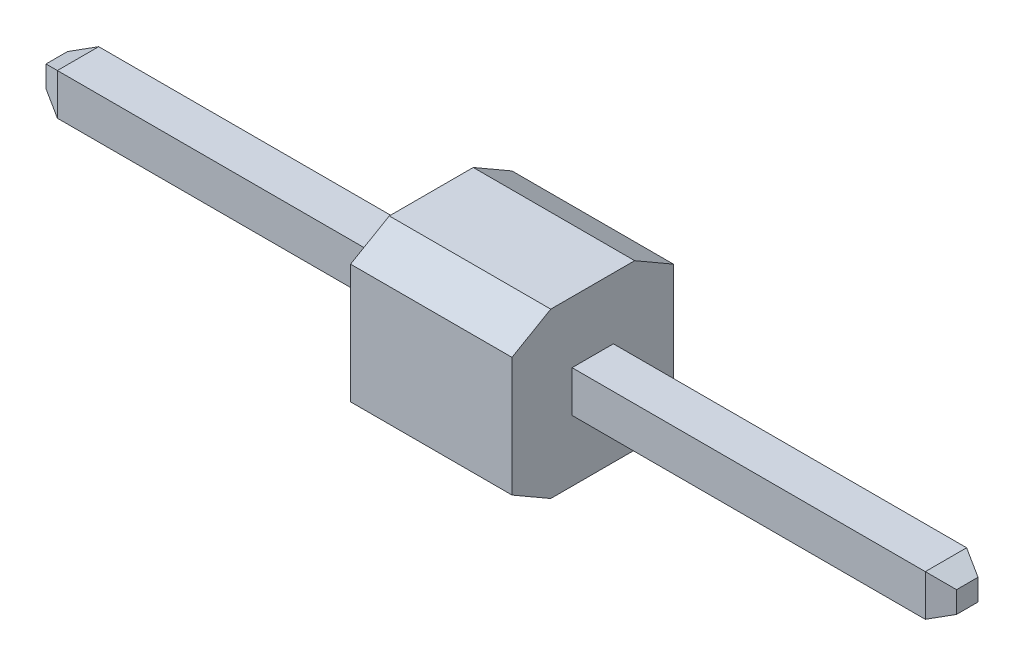
ISO-10303-21;
HEADER;
FILE_DESCRIPTION(('STEP AP214'),'2;1');
FILE_NAME('part.step','',(''),(''),'','','');
FILE_SCHEMA(('AUTOMOTIVE_DESIGN { 1 0 10303 214 1 1 1 1 }'));
ENDSEC;
DATA;
#1=APPLICATION_CONTEXT('core data for automotive mechanical design processes');
#2=APPLICATION_PROTOCOL_DEFINITION('international standard','automotive_design',2000,#1);
#3=PRODUCT_CONTEXT('',#1,'mechanical');
#4=PRODUCT('Part','Part','',(#3));
#5=PRODUCT_RELATED_PRODUCT_CATEGORY('part','',(#4));
#6=PRODUCT_DEFINITION_FORMATION('','',#4);
#7=PRODUCT_DEFINITION_CONTEXT('part definition',#1,'design');
#8=PRODUCT_DEFINITION('design','',#6,#7);
#9=PRODUCT_DEFINITION_SHAPE('','',#8);
#10=(LENGTH_UNIT() NAMED_UNIT(*) SI_UNIT(.MILLI.,.METRE.));
#11=(NAMED_UNIT(*) PLANE_ANGLE_UNIT() SI_UNIT($,.RADIAN.));
#12=(NAMED_UNIT(*) SI_UNIT($,.STERADIAN.) SOLID_ANGLE_UNIT());
#13=UNCERTAINTY_MEASURE_WITH_UNIT(LENGTH_MEASURE(1.E-05),#10,'distance_accuracy_value','');
#14=(GEOMETRIC_REPRESENTATION_CONTEXT(3) GLOBAL_UNCERTAINTY_ASSIGNED_CONTEXT((#13)) GLOBAL_UNIT_ASSIGNED_CONTEXT((#10,
#11,#12)) REPRESENTATION_CONTEXT('',''));
#15=CARTESIAN_POINT('',(0.,0.,0.));
#16=DIRECTION('',(0.,0.,1.));
#17=DIRECTION('',(1.,0.,0.));
#18=AXIS2_PLACEMENT_3D('',#15,#16,#17);
#19=CARTESIAN_POINT('',(5.42107483451908,2.2228784128063,0.629998634255617));
#20=DIRECTION('',(1.,4.37113882867379E-08,-4.37113882867379E-08));
#21=DIRECTION('',(-4.37113882867379E-08,1.,0.));
#22=AXIS2_PLACEMENT_3D('',#19,#20,#21);
#23=PLANE('',#22);
#24=DIRECTION('',(1.59994790123753E-08,0.500000000000193,0.866025403784327));
#25=VECTOR('',#24,1.);
#26=CARTESIAN_POINT('',(5.42107471153316,3.4664682512923,-0.940001365744382));
#27=LINE('',#26,#25);
#28=CARTESIAN_POINT('',(5.42107471153316,3.4664682512923,-0.940001365744382));
#29=VERTEX_POINT('',#28);
#30=CARTESIAN_POINT('',(5.42107472261793,3.8128784128063,-0.340001365744383));
#31=VERTEX_POINT('',#30);
#32=EDGE_CURVE('E11',#29,#31,#27,.T.);
#33=ORIENTED_EDGE('',*,*,#32,.T.);
#34=DIRECTION('',(4.37113880134522E-08,0.,0.999999999999999));
#35=VECTOR('',#34,1.);
#36=CARTESIAN_POINT('',(5.42107472261793,3.8128784128063,-0.340001365744383));
#37=LINE('',#36,#35);
#38=CARTESIAN_POINT('',(5.42107477944273,3.8128784128063,0.959998634255618));
#39=VERTEX_POINT('',#38);
#40=EDGE_CURVE('E304',#31,#39,#37,.T.);
#41=ORIENTED_EDGE('',*,*,#40,.T.);
#42=DIRECTION('',(5.97108668824037E-08,-0.500000000000186,0.866025403784329));
#43=VECTOR('',#42,1.);
#44=CARTESIAN_POINT('',(5.42107477944273,3.8128784128063,0.959998634255618));
#45=LINE('',#44,#43);
#46=CARTESIAN_POINT('',(5.42107482081163,3.46646825129231,1.55999863425562));
#47=VERTEX_POINT('',#46);
#48=EDGE_CURVE('E296',#39,#47,#45,.T.);
#49=ORIENTED_EDGE('',*,*,#48,.T.);
#50=DIRECTION('',(4.37113884816491E-08,-0.999999999999999,0.));
#51=VECTOR('',#50,1.);
#52=CARTESIAN_POINT('',(5.42107482081163,3.46646825129231,1.55999863425562));
#53=LINE('',#52,#51);
#54=CARTESIAN_POINT('',(5.42107490155442,1.6192885743263,1.55999863425562));
#55=VERTEX_POINT('',#54);
#56=EDGE_CURVE('E281',#47,#55,#53,.T.);
#57=ORIENTED_EDGE('',*,*,#56,.T.);
#58=DIRECTION('',(1.5999479012306E-08,0.500000000000192,0.866025403784328));
#59=VECTOR('',#58,1.);
#60=CARTESIAN_POINT('',(5.42107489046966,1.2728784128063,0.959998634255618));
#61=LINE('',#60,#59);
#62=CARTESIAN_POINT('',(5.42107489046966,1.2728784128063,0.959998634255618));
#63=VERTEX_POINT('',#62);
#64=EDGE_CURVE('E265',#63,#55,#61,.T.);
#65=ORIENTED_EDGE('',*,*,#64,.F.);
#66=DIRECTION('',(4.37113886966664E-08,0.,0.999999999999999));
#67=VECTOR('',#66,1.);
#68=CARTESIAN_POINT('',(5.42107483364485,1.2728784128063,-0.340001365744383));
#69=LINE('',#68,#67);
#70=CARTESIAN_POINT('',(5.42107483364485,1.2728784128063,-0.340001365744383));
#71=VERTEX_POINT('',#70);
#72=EDGE_CURVE('E248',#71,#63,#69,.T.);
#73=ORIENTED_EDGE('',*,*,#72,.F.);
#74=DIRECTION('',(5.971086560017E-08,-0.500000000000187,0.866025403784329));
#75=VECTOR('',#74,1.);
#76=CARTESIAN_POINT('',(5.42107479227595,1.6192885743263,-0.940001365744382));
#77=LINE('',#76,#75);
#78=CARTESIAN_POINT('',(5.42107479227595,1.6192885743263,-0.940001365744382));
#79=VERTEX_POINT('',#78);
#80=EDGE_CURVE('E242',#79,#71,#77,.T.);
#81=ORIENTED_EDGE('',*,*,#80,.F.);
#82=DIRECTION('',(4.37113884816491E-08,-0.999999999999999,0.));
#83=VECTOR('',#82,1.);
#84=CARTESIAN_POINT('',(5.42107471153316,3.4664682512923,-0.940001365744382));
#85=LINE('',#84,#83);
#86=EDGE_CURVE('E236',#29,#79,#85,.T.);
#87=ORIENTED_EDGE('',*,*,#86,.F.);
#88=EDGE_LOOP('',(#33,#41,#49,#57,#65,#73,#81,#87));
#89=FACE_BOUND('',#88,.T.);
#90=DIRECTION('',(-4.37113886753159E-08,0.,-0.999999999999999));
#91=VECTOR('',#90,1.);
#92=CARTESIAN_POINT('',(5.42107480654379,2.8628784128063,0.629998634255617));
#93=LINE('',#92,#91);
#94=CARTESIAN_POINT('',(5.42107480654379,2.8628784128063,0.629998634255617));
#95=VERTEX_POINT('',#94);
#96=CARTESIAN_POINT('',(5.4210747785685,2.8628784128063,-0.0100013657443826));
#97=VERTEX_POINT('',#96);
#98=EDGE_CURVE('E302',#95,#97,#93,.T.);
#99=ORIENTED_EDGE('',*,*,#98,.T.);
#100=DIRECTION('',(-4.37113886753159E-08,0.999999999999999,0.));
#101=VECTOR('',#100,1.);
#102=CARTESIAN_POINT('',(5.42107480654379,2.2228784128063,-0.0100013657443826));
#103=LINE('',#102,#101);
#104=CARTESIAN_POINT('',(5.42107480654379,2.2228784128063,-0.0100013657443826));
#105=VERTEX_POINT('',#104);
#106=EDGE_CURVE('E293',#105,#97,#103,.T.);
#107=ORIENTED_EDGE('',*,*,#106,.F.);
#108=DIRECTION('',(-4.37113886753159E-08,0.,-0.999999999999999));
#109=VECTOR('',#108,1.);
#110=CARTESIAN_POINT('',(5.42107483451908,2.2228784128063,0.629998634255617));
#111=LINE('',#110,#109);
#112=CARTESIAN_POINT('',(5.42107483451908,2.2228784128063,0.629998634255617));
#113=VERTEX_POINT('',#112);
#114=EDGE_CURVE('E278',#113,#105,#111,.T.);
#115=ORIENTED_EDGE('',*,*,#114,.F.);
#116=DIRECTION('',(-4.37113886753159E-08,0.999999999999999,0.));
#117=VECTOR('',#116,1.);
#118=CARTESIAN_POINT('',(5.42107483451908,2.2228784128063,0.629998634255617));
#119=LINE('',#118,#117);
#120=EDGE_CURVE('E263',#113,#95,#119,.T.);
#121=ORIENTED_EDGE('',*,*,#120,.T.);
#122=EDGE_LOOP('',(#99,#107,#115,#121));
#123=FACE_BOUND('',#122,.T.);
#124=ADVANCED_FACE('F17',(#89,#123),#23,.T.);
#125=CARTESIAN_POINT('',(2.92107483451908,2.22287830352783,0.629998743534088));
#126=DIRECTION('',(1.,4.37113882867379E-08,-4.37113882867379E-08));
#127=DIRECTION('',(-4.37113882867379E-08,1.,0.));
#128=AXIS2_PLACEMENT_3D('',#125,#126,#127);
#129=PLANE('',#128);
#130=DIRECTION('',(1.59994790123753E-08,0.500000000000193,0.866025403784327));
#131=VECTOR('',#130,1.);
#132=CARTESIAN_POINT('',(2.92107471153316,3.46646814201383,-0.940001256465912));
#133=LINE('',#132,#131);
#134=CARTESIAN_POINT('',(2.92107471153316,3.46646814201383,-0.940001256465912));
#135=VERTEX_POINT('',#134);
#136=CARTESIAN_POINT('',(2.92107472261793,3.81287830352783,-0.340001256465912));
#137=VERTEX_POINT('',#136);
#138=EDGE_CURVE('E24',#135,#137,#133,.T.);
#139=ORIENTED_EDGE('',*,*,#138,.F.);
#140=DIRECTION('',(4.37113884816491E-08,-0.999999999999999,0.));
#141=VECTOR('',#140,1.);
#142=CARTESIAN_POINT('',(2.92107471153316,3.46646814201383,-0.940001256465912));
#143=LINE('',#142,#141);
#144=CARTESIAN_POINT('',(2.92107479227595,1.61928846504783,-0.940001256465912));
#145=VERTEX_POINT('',#144);
#146=EDGE_CURVE('E300',#135,#145,#143,.T.);
#147=ORIENTED_EDGE('',*,*,#146,.T.);
#148=DIRECTION('',(5.97108662411576E-08,-0.500000000000187,0.866025403784329));
#149=VECTOR('',#148,1.);
#150=CARTESIAN_POINT('',(2.92107479227595,1.61928846504783,-0.940001256465912));
#151=LINE('',#150,#149);
#152=CARTESIAN_POINT('',(2.92107483364485,1.27287830352783,-0.340001256465912));
#153=VERTEX_POINT('',#152);
#154=EDGE_CURVE('E286',#145,#153,#151,.T.);
#155=ORIENTED_EDGE('',*,*,#154,.T.);
#156=DIRECTION('',(4.37113883550593E-08,0.,0.999999999999999));
#157=VECTOR('',#156,1.);
#158=CARTESIAN_POINT('',(2.92107483364485,1.27287830352783,-0.340001256465912));
#159=LINE('',#158,#157);
#160=CARTESIAN_POINT('',(2.92107489046966,1.27287830352783,0.959998743534088));
#161=VERTEX_POINT('',#160);
#162=EDGE_CURVE('E271',#153,#161,#159,.T.);
#163=ORIENTED_EDGE('',*,*,#162,.T.);
#164=DIRECTION('',(1.5999479012306E-08,0.500000000000192,0.866025403784328));
#165=VECTOR('',#164,1.);
#166=CARTESIAN_POINT('',(2.92107489046966,1.27287830352783,0.959998743534088));
#167=LINE('',#166,#165);
#168=CARTESIAN_POINT('',(2.92107490155442,1.61928846504783,1.55999874353409));
#169=VERTEX_POINT('',#168);
#170=EDGE_CURVE('E253',#161,#169,#167,.T.);
#171=ORIENTED_EDGE('',*,*,#170,.T.);
#172=DIRECTION('',(4.37113884816491E-08,-0.999999999999999,0.));
#173=VECTOR('',#172,1.);
#174=CARTESIAN_POINT('',(2.92107482081163,3.46646814201383,1.55999874353409));
#175=LINE('',#174,#173);
#176=CARTESIAN_POINT('',(2.92107482081163,3.46646814201383,1.55999874353409));
#177=VERTEX_POINT('',#176);
#178=EDGE_CURVE('E261',#177,#169,#175,.T.);
#179=ORIENTED_EDGE('',*,*,#178,.F.);
#180=DIRECTION('',(5.97108668824037E-08,-0.500000000000186,0.866025403784329));
#181=VECTOR('',#180,1.);
#182=CARTESIAN_POINT('',(2.92107477944273,3.81287830352783,0.959998743534088));
#183=LINE('',#182,#181);
#184=CARTESIAN_POINT('',(2.92107477944273,3.81287830352783,0.959998743534088));
#185=VERTEX_POINT('',#184);
#186=EDGE_CURVE('E276',#185,#177,#183,.T.);
#187=ORIENTED_EDGE('',*,*,#186,.F.);
#188=DIRECTION('',(4.37113880134522E-08,0.,0.999999999999999));
#189=VECTOR('',#188,1.);
#190=CARTESIAN_POINT('',(2.92107472261793,3.81287830352783,-0.340001256465912));
#191=LINE('',#190,#189);
#192=EDGE_CURVE('E291',#137,#185,#191,.T.);
#193=ORIENTED_EDGE('',*,*,#192,.F.);
#194=EDGE_LOOP('',(#139,#147,#155,#163,#171,#179,#187,#193));
#195=FACE_BOUND('',#194,.T.);
#196=DIRECTION('',(-4.37113886753159E-08,0.999999999999999,0.));
#197=VECTOR('',#196,1.);
#198=CARTESIAN_POINT('',(2.92107480654379,2.22287830352783,-0.0100012564659119));
#199=LINE('',#198,#197);
#200=CARTESIAN_POINT('',(2.92107480654379,2.22287830352783,-0.0100012564659119));
#201=VERTEX_POINT('',#200);
#202=CARTESIAN_POINT('',(2.9210747785685,2.86287830352783,-0.0100012564659119));
#203=VERTEX_POINT('',#202);
#204=EDGE_CURVE('E298',#201,#203,#199,.T.);
#205=ORIENTED_EDGE('',*,*,#204,.T.);
#206=DIRECTION('',(-4.37113886753159E-08,0.,-0.999999999999999));
#207=VECTOR('',#206,1.);
#208=CARTESIAN_POINT('',(2.92107480654379,2.86287830352783,0.629998743534088));
#209=LINE('',#208,#207);
#210=CARTESIAN_POINT('',(2.92107480654379,2.86287830352783,0.629998743534088));
#211=VERTEX_POINT('',#210);
#212=EDGE_CURVE('E283',#211,#203,#209,.T.);
#213=ORIENTED_EDGE('',*,*,#212,.F.);
#214=DIRECTION('',(-4.37113879814265E-08,0.999999999999999,0.));
#215=VECTOR('',#214,1.);
#216=CARTESIAN_POINT('',(2.92107483451908,2.22287830352783,0.629998743534088));
#217=LINE('',#216,#215);
#218=CARTESIAN_POINT('',(2.92107483451908,2.22287830352783,0.629998743534088));
#219=VERTEX_POINT('',#218);
#220=EDGE_CURVE('E268',#219,#211,#217,.T.);
#221=ORIENTED_EDGE('',*,*,#220,.F.);
#222=DIRECTION('',(-4.37113879814266E-08,0.,-0.999999999999999));
#223=VECTOR('',#222,1.);
#224=CARTESIAN_POINT('',(2.92107483451908,2.22287830352783,0.629998743534088));
#225=LINE('',#224,#223);
#226=EDGE_CURVE('E251',#219,#201,#225,.T.);
#227=ORIENTED_EDGE('',*,*,#226,.T.);
#228=EDGE_LOOP('',(#205,#213,#221,#227));
#229=FACE_BOUND('',#228,.T.);
#230=ADVANCED_FACE('F314',(#195,#229),#129,.F.);
#231=CARTESIAN_POINT('',(5.42107471153316,3.4664682512923,-0.940001365744382));
#232=DIRECTION('',(5.97108668343731E-08,-0.866025403784328,0.50000000000019));
#233=DIRECTION('',(-1.59994785476185E-08,-0.500000000000192,-0.866025403784329));
#234=AXIS2_PLACEMENT_3D('',#231,#232,#233);
#235=PLANE('',#234);
#236=ORIENTED_EDGE('',*,*,#138,.T.);
#237=DIRECTION('',(-0.999999999999998,-4.37113882867378E-08,4.37113883755557E-08));
#238=VECTOR('',#237,1.);
#239=CARTESIAN_POINT('',(5.42107472261793,3.8128784128063,-0.340001365744383));
#240=LINE('',#239,#238);
#241=EDGE_CURVE('E288',#31,#137,#240,.T.);
#242=ORIENTED_EDGE('',*,*,#241,.F.);
#243=ORIENTED_EDGE('',*,*,#32,.F.);
#244=DIRECTION('',(-0.999999999999998,-4.37113889972806E-08,4.37113881091022E-08));
#245=VECTOR('',#244,1.);
#246=CARTESIAN_POINT('',(5.42107471153316,3.4664682512923,-0.940001365744382));
#247=LINE('',#246,#245);
#248=EDGE_CURVE('E256',#29,#135,#247,.T.);
#249=ORIENTED_EDGE('',*,*,#248,.T.);
#250=EDGE_LOOP('',(#236,#242,#243,#249));
#251=FACE_BOUND('',#250,.T.);
#252=ADVANCED_FACE('F306',(#251),#235,.F.);
#253=CARTESIAN_POINT('',(5.42107472261793,3.8128784128063,-0.340001365744383));
#254=DIRECTION('',(4.37113882867379E-08,-1.,0.));
#255=DIRECTION('',(1.,4.37113882867379E-08,-4.37113882867379E-08));
#256=AXIS2_PLACEMENT_3D('',#253,#254,#255);
#257=PLANE('',#256);
#258=ORIENTED_EDGE('',*,*,#192,.T.);
#259=DIRECTION('',(-0.999999999999998,-4.37113882867378E-08,4.37113882867378E-08));
#260=VECTOR('',#259,1.);
#261=CARTESIAN_POINT('',(5.42107477944273,3.8128784128063,0.959998634255618));
#262=LINE('',#261,#260);
#263=EDGE_CURVE('E273',#39,#185,#262,.T.);
#264=ORIENTED_EDGE('',*,*,#263,.F.);
#265=ORIENTED_EDGE('',*,*,#40,.F.);
#266=ORIENTED_EDGE('',*,*,#241,.T.);
#267=EDGE_LOOP('',(#258,#264,#265,#266));
#268=FACE_BOUND('',#267,.T.);
#269=ADVANCED_FACE('F311',(#268),#257,.F.);
#270=CARTESIAN_POINT('',(5.42107477944273,3.8128784128063,0.959998634255618));
#271=DIRECTION('',(1.59994785476185E-08,-0.86602540378433,-0.50000000000019));
#272=DIRECTION('',(-5.97108668343731E-08,0.500000000000188,-0.866025403784329));
#273=AXIS2_PLACEMENT_3D('',#270,#271,#272);
#274=PLANE('',#273);
#275=ORIENTED_EDGE('',*,*,#186,.T.);
#276=DIRECTION('',(-0.999999999999998,-4.37113889972806E-08,4.37113882867378E-08));
#277=VECTOR('',#276,1.);
#278=CARTESIAN_POINT('',(5.42107482081163,3.46646825129231,1.55999863425562));
#279=LINE('',#278,#277);
#280=EDGE_CURVE('E258',#47,#177,#279,.T.);
#281=ORIENTED_EDGE('',*,*,#280,.F.);
#282=ORIENTED_EDGE('',*,*,#48,.F.);
#283=ORIENTED_EDGE('',*,*,#263,.T.);
#284=EDGE_LOOP('',(#275,#281,#282,#283));
#285=FACE_BOUND('',#284,.T.);
#286=ADVANCED_FACE('F319',(#285),#274,.F.);
#287=CARTESIAN_POINT('',(5.42107482081163,3.46646825129231,1.55999863425562));
#288=DIRECTION('',(-4.37113882867379E-08,0.,-1.));
#289=DIRECTION('',(-1.,-4.37113882867379E-08,4.37113882867379E-08));
#290=AXIS2_PLACEMENT_3D('',#287,#288,#289);
#291=PLANE('',#290);
#292=ORIENTED_EDGE('',*,*,#178,.T.);
#293=DIRECTION('',(-0.999999999999998,-4.37113889972806E-08,4.37113882867378E-08));
#294=VECTOR('',#293,1.);
#295=CARTESIAN_POINT('',(5.42107490155442,1.6192885743263,1.55999863425562));
#296=LINE('',#295,#294);
#297=EDGE_CURVE('E245',#55,#169,#296,.T.);
#298=ORIENTED_EDGE('',*,*,#297,.F.);
#299=ORIENTED_EDGE('',*,*,#56,.F.);
#300=ORIENTED_EDGE('',*,*,#280,.T.);
#301=EDGE_LOOP('',(#292,#298,#299,#300));
#302=FACE_BOUND('',#301,.T.);
#303=ADVANCED_FACE('F326',(#302),#291,.F.);
#304=CARTESIAN_POINT('',(5.42107489046966,1.2728784128063,0.959998634255618));
#305=DIRECTION('',(5.97108668343731E-08,-0.866025403784328,0.50000000000019));
#306=DIRECTION('',(-1.59994785476185E-08,-0.500000000000192,-0.866025403784329));
#307=AXIS2_PLACEMENT_3D('',#304,#305,#306);
#308=PLANE('',#307);
#309=ORIENTED_EDGE('',*,*,#170,.F.);
#310=DIRECTION('',(-0.999999999999998,-4.37113882867378E-08,4.37113882867378E-08));
#311=VECTOR('',#310,1.);
#312=CARTESIAN_POINT('',(5.42107489046966,1.2728784128063,0.959998634255618));
#313=LINE('',#312,#311);
#314=EDGE_CURVE('E239',#63,#161,#313,.T.);
#315=ORIENTED_EDGE('',*,*,#314,.F.);
#316=ORIENTED_EDGE('',*,*,#64,.T.);
#317=ORIENTED_EDGE('',*,*,#297,.T.);
#318=EDGE_LOOP('',(#309,#315,#316,#317));
#319=FACE_BOUND('',#318,.T.);
#320=ADVANCED_FACE('F329',(#319),#308,.T.);
#321=CARTESIAN_POINT('',(5.42107483364485,1.2728784128063,-0.340001365744383));
#322=DIRECTION('',(4.37113882867379E-08,-1.,0.));
#323=DIRECTION('',(1.,4.37113882867379E-08,-4.37113882867379E-08));
#324=AXIS2_PLACEMENT_3D('',#321,#322,#323);
#325=PLANE('',#324);
#326=ORIENTED_EDGE('',*,*,#162,.F.);
#327=DIRECTION('',(-0.999999999999998,-4.37113882867378E-08,4.37113883755557E-08));
#328=VECTOR('',#327,1.);
#329=CARTESIAN_POINT('',(5.42107483364485,1.2728784128063,-0.340001365744383));
#330=LINE('',#329,#328);
#331=EDGE_CURVE('E233',#71,#153,#330,.T.);
#332=ORIENTED_EDGE('',*,*,#331,.F.);
#333=ORIENTED_EDGE('',*,*,#72,.T.);
#334=ORIENTED_EDGE('',*,*,#314,.T.);
#335=EDGE_LOOP('',(#326,#332,#333,#334));
#336=FACE_BOUND('',#335,.T.);
#337=ADVANCED_FACE('F333',(#336),#325,.T.);
#338=CARTESIAN_POINT('',(5.42107479227595,1.6192885743263,-0.940001365744382));
#339=DIRECTION('',(1.59994785476185E-08,-0.86602540378433,-0.50000000000019));
#340=DIRECTION('',(-5.97108668343731E-08,0.500000000000188,-0.866025403784329));
#341=AXIS2_PLACEMENT_3D('',#338,#339,#340);
#342=PLANE('',#341);
#343=ORIENTED_EDGE('',*,*,#154,.F.);
#344=DIRECTION('',(-0.999999999999998,-4.37113889972806E-08,4.37113881091022E-08));
#345=VECTOR('',#344,1.);
#346=CARTESIAN_POINT('',(5.42107479227595,1.6192885743263,-0.940001365744382));
#347=LINE('',#346,#345);
#348=EDGE_CURVE('E230',#79,#145,#347,.T.);
#349=ORIENTED_EDGE('',*,*,#348,.F.);
#350=ORIENTED_EDGE('',*,*,#80,.T.);
#351=ORIENTED_EDGE('',*,*,#331,.T.);
#352=EDGE_LOOP('',(#343,#349,#350,#351));
#353=FACE_BOUND('',#352,.T.);
#354=ADVANCED_FACE('F337',(#353),#342,.T.);
#355=CARTESIAN_POINT('',(5.42107471153316,3.4664682512923,-0.940001365744382));
#356=DIRECTION('',(-4.37113882867379E-08,0.,-1.));
#357=DIRECTION('',(-4.37113882867379E-08,1.,0.));
#358=AXIS2_PLACEMENT_3D('',#355,#356,#357);
#359=PLANE('',#358);
#360=ORIENTED_EDGE('',*,*,#146,.F.);
#361=ORIENTED_EDGE('',*,*,#248,.F.);
#362=ORIENTED_EDGE('',*,*,#86,.T.);
#363=ORIENTED_EDGE('',*,*,#348,.T.);
#364=EDGE_LOOP('',(#360,#361,#362,#363));
#365=FACE_BOUND('',#364,.T.);
#366=ADVANCED_FACE('F339',(#365),#359,.T.);
#367=CARTESIAN_POINT('',(-2.87892516548092,2.22287805000178,0.62999899706014));
#368=DIRECTION('',(-1.,-4.37113882867379E-08,4.37113882867379E-08));
#369=DIRECTION('',(4.37113882867379E-08,-1.,0.));
#370=AXIS2_PLACEMENT_3D('',#367,#368,#369);
#371=PLANE('',#370);
#372=DIRECTION('',(4.37113847292273E-08,-0.999999999999999,0.));
#373=VECTOR('',#372,1.);
#374=CARTESIAN_POINT('',(-2.87892520797874,2.70899652281078,0.14388052425114));
#375=LINE('',#374,#373);
#376=CARTESIAN_POINT('',(-2.87892520797874,2.70899652281078,0.14388052425114));
#377=VERTEX_POINT('',#376);
#378=CARTESIAN_POINT('',(-2.87892519345621,2.37675957720178,0.14388052425114));
#379=VERTEX_POINT('',#378);
#380=EDGE_CURVE('E228',#377,#379,#375,.T.);
#381=ORIENTED_EDGE('',*,*,#380,.T.);
#382=DIRECTION('',(4.37113874013716E-08,0.,0.999999999999999));
#383=VECTOR('',#382,1.);
#384=CARTESIAN_POINT('',(-2.87892519345621,2.37675957720178,0.14388052425114));
#385=LINE('',#384,#383);
#386=CARTESIAN_POINT('',(-2.87892517893367,2.37675957720178,0.47611746986914));
#387=VERTEX_POINT('',#386);
#388=EDGE_CURVE('E223',#379,#387,#385,.T.);
#389=ORIENTED_EDGE('',*,*,#388,.T.);
#390=DIRECTION('',(-4.37113900758839E-08,0.999999999999999,0.));
#391=VECTOR('',#390,1.);
#392=CARTESIAN_POINT('',(-2.87892517893367,2.37675957720178,0.47611746986914));
#393=LINE('',#392,#391);
#394=CARTESIAN_POINT('',(-2.87892519345621,2.70899652281078,0.47611746986914));
#395=VERTEX_POINT('',#394);
#396=EDGE_CURVE('E215',#387,#395,#393,.T.);
#397=ORIENTED_EDGE('',*,*,#396,.T.);
#398=DIRECTION('',(-4.37113820547151E-08,0.,-0.999999999999999));
#399=VECTOR('',#398,1.);
#400=CARTESIAN_POINT('',(-2.87892519345621,2.70899652281078,0.47611746986914));
#401=LINE('',#400,#399);
#402=EDGE_CURVE('E207',#395,#377,#401,.T.);
#403=ORIENTED_EDGE('',*,*,#402,.T.);
#404=EDGE_LOOP('',(#381,#389,#397,#403));
#405=FACE_BOUND('',#404,.T.);
#406=ADVANCED_FACE('F341',(#405),#371,.T.);
#407=CARTESIAN_POINT('',(-2.87892516548092,2.22287805000178,0.62999899706014));
#408=DIRECTION('',(4.37113882867379E-08,-1.,0.));
#409=DIRECTION('',(-4.37113882867379E-08,0.,-1.));
#410=AXIS2_PLACEMENT_3D('',#407,#408,#409);
#411=PLANE('',#410);
#412=DIRECTION('',(0.999999999999998,4.37113888452998E-08,-4.37113882769955E-08));
#413=VECTOR('',#412,1.);
#414=CARTESIAN_POINT('',(-2.54892516548092,2.22287806442654,0.629998982635382));
#415=LINE('',#414,#413);
#416=CARTESIAN_POINT('',(-2.54892516548092,2.22287806442654,0.629998982635382));
#417=VERTEX_POINT('',#416);
#418=EDGE_CURVE('E225',#417,#219,#415,.T.);
#419=ORIENTED_EDGE('',*,*,#418,.F.);
#420=DIRECTION('',(-4.37113886753159E-08,0.,-0.999999999999999));
#421=VECTOR('',#420,1.);
#422=CARTESIAN_POINT('',(-2.54892516548092,2.22287806442654,0.629998982635382));
#423=LINE('',#422,#421);
#424=CARTESIAN_POINT('',(-2.54892519345621,2.22287806442654,-0.010001017364618));
#425=VERTEX_POINT('',#424);
#426=EDGE_CURVE('E217',#417,#425,#423,.T.);
#427=ORIENTED_EDGE('',*,*,#426,.T.);
#428=DIRECTION('',(0.999999999999998,4.37113888452998E-08,-4.37113882161057E-08));
#429=VECTOR('',#428,1.);
#430=CARTESIAN_POINT('',(-2.54892519345621,2.22287806442654,-0.010001017364618));
#431=LINE('',#430,#429);
#432=EDGE_CURVE('E220',#425,#201,#431,.T.);
#433=ORIENTED_EDGE('',*,*,#432,.T.);
#434=ORIENTED_EDGE('',*,*,#226,.F.);
#435=EDGE_LOOP('',(#419,#427,#433,#434));
#436=FACE_BOUND('',#435,.T.);
#437=ADVANCED_FACE('F348',(#436),#411,.T.);
#438=CARTESIAN_POINT('',(-2.87892519345621,2.22287805000178,-0.0100010029398598));
#439=DIRECTION('',(-4.37113882867379E-08,0.,-1.));
#440=DIRECTION('',(-1.,-4.37113882867379E-08,4.37113882867379E-08));
#441=AXIS2_PLACEMENT_3D('',#438,#439,#440);
#442=PLANE('',#441);
#443=ORIENTED_EDGE('',*,*,#432,.F.);
#444=DIRECTION('',(-4.37113886753159E-08,0.999999999999999,0.));
#445=VECTOR('',#444,1.);
#446=CARTESIAN_POINT('',(-2.54892519345621,2.22287806442654,-0.010001017364618));
#447=LINE('',#446,#445);
#448=CARTESIAN_POINT('',(-2.5489252214315,2.86287806442654,-0.010001017364618));
#449=VERTEX_POINT('',#448);
#450=EDGE_CURVE('E209',#425,#449,#447,.T.);
#451=ORIENTED_EDGE('',*,*,#450,.T.);
#452=DIRECTION('',(0.999999999999998,4.37113888452998E-08,-4.37113882161057E-08));
#453=VECTOR('',#452,1.);
#454=CARTESIAN_POINT('',(-2.5489252214315,2.86287806442654,-0.010001017364618));
#455=LINE('',#454,#453);
#456=EDGE_CURVE('E212',#449,#203,#455,.T.);
#457=ORIENTED_EDGE('',*,*,#456,.T.);
#458=ORIENTED_EDGE('',*,*,#204,.F.);
#459=EDGE_LOOP('',(#443,#451,#457,#458));
#460=FACE_BOUND('',#459,.T.);
#461=ADVANCED_FACE('F424',(#460),#442,.T.);
#462=CARTESIAN_POINT('',(-2.87892519345621,2.86287805000178,0.62999899706014));
#463=DIRECTION('',(4.37113882867379E-08,-1.,0.));
#464=DIRECTION('',(-4.37113882867379E-08,0.,-1.));
#465=AXIS2_PLACEMENT_3D('',#462,#463,#464);
#466=PLANE('',#465);
#467=ORIENTED_EDGE('',*,*,#456,.F.);
#468=DIRECTION('',(4.37113900630947E-08,0.,0.999999999999999));
#469=VECTOR('',#468,1.);
#470=CARTESIAN_POINT('',(-2.5489252214315,2.86287806442654,-0.010001017364618));
#471=LINE('',#470,#469);
#472=CARTESIAN_POINT('',(-2.54892519345621,2.86287806442654,0.629998982635382));
#473=VERTEX_POINT('',#472);
#474=EDGE_CURVE('E201',#449,#473,#471,.T.);
#475=ORIENTED_EDGE('',*,*,#474,.T.);
#476=DIRECTION('',(0.999999999999998,4.37113888452998E-08,-4.37113882769955E-08));
#477=VECTOR('',#476,1.);
#478=CARTESIAN_POINT('',(-2.54892519345621,2.86287806442654,0.629998982635382));
#479=LINE('',#478,#477);
#480=EDGE_CURVE('E204',#473,#211,#479,.T.);
#481=ORIENTED_EDGE('',*,*,#480,.T.);
#482=ORIENTED_EDGE('',*,*,#212,.T.);
#483=EDGE_LOOP('',(#467,#475,#481,#482));
#484=FACE_BOUND('',#483,.T.);
#485=ADVANCED_FACE('F421',(#484),#466,.F.);
#486=CARTESIAN_POINT('',(-2.87892516548092,2.22287805000178,0.62999899706014));
#487=DIRECTION('',(-4.37113882867379E-08,0.,-1.));
#488=DIRECTION('',(-1.,-4.37113882867379E-08,4.37113882867379E-08));
#489=AXIS2_PLACEMENT_3D('',#486,#487,#488);
#490=PLANE('',#489);
#491=ORIENTED_EDGE('',*,*,#480,.F.);
#492=DIRECTION('',(4.37113872875371E-08,-0.999999999999999,0.));
#493=VECTOR('',#492,1.);
#494=CARTESIAN_POINT('',(-2.54892519345621,2.86287806442654,0.629998982635382));
#495=LINE('',#494,#493);
#496=EDGE_CURVE('E196',#473,#417,#495,.T.);
#497=ORIENTED_EDGE('',*,*,#496,.T.);
#498=ORIENTED_EDGE('',*,*,#418,.T.);
#499=ORIENTED_EDGE('',*,*,#220,.T.);
#500=EDGE_LOOP('',(#491,#497,#498,#499));
#501=FACE_BOUND('',#500,.T.);
#502=ADVANCED_FACE('F376',(#501),#490,.F.);
#503=CARTESIAN_POINT('',(-2.87892516548092,2.22287805000178,0.62999899706014));
#504=DIRECTION('',(-4.37113882867379E-08,0.,-1.));
#505=DIRECTION('',(-1.,-4.37113882867379E-08,4.37113882867379E-08));
#506=AXIS2_PLACEMENT_3D('',#503,#504,#505);
#507=PLANE('',#506);
#508=DIRECTION('',(0.999999999999998,4.37113881958092E-08,-4.37113882769955E-08));
#509=VECTOR('',#508,1.);
#510=CARTESIAN_POINT('',(5.42107483451908,2.22287841280631,0.629998634255617));
#511=LINE('',#510,#509);
#512=CARTESIAN_POINT('',(10.8910748345191,2.2228786519076,0.629998395154324));
#513=VERTEX_POINT('',#512);
#514=EDGE_CURVE('E199',#113,#513,#511,.T.);
#515=ORIENTED_EDGE('',*,*,#514,.T.);
#516=DIRECTION('',(-4.37113900630947E-08,0.999999999999999,0.));
#517=VECTOR('',#516,1.);
#518=CARTESIAN_POINT('',(10.8910748345191,2.2228786519076,0.629998395154324));
#519=LINE('',#518,#517);
#520=CARTESIAN_POINT('',(10.8910748065438,2.8628786519076,0.629998395154324));
#521=VERTEX_POINT('',#520);
#522=EDGE_CURVE('E191',#513,#521,#519,.T.);
#523=ORIENTED_EDGE('',*,*,#522,.T.);
#524=DIRECTION('',(0.999999999999998,4.37113881958092E-08,-4.37113882769955E-08));
#525=VECTOR('',#524,1.);
#526=CARTESIAN_POINT('',(5.42107480654379,2.86287841280631,0.629998634255617));
#527=LINE('',#526,#525);
#528=EDGE_CURVE('E194',#95,#521,#527,.T.);
#529=ORIENTED_EDGE('',*,*,#528,.F.);
#530=ORIENTED_EDGE('',*,*,#120,.F.);
#531=EDGE_LOOP('',(#515,#523,#529,#530));
#532=FACE_BOUND('',#531,.T.);
#533=ADVANCED_FACE('F367',(#532),#507,.F.);
#534=CARTESIAN_POINT('',(-2.87892519345621,2.86287805000178,0.62999899706014));
#535=DIRECTION('',(4.37113882867379E-08,-1.,0.));
#536=DIRECTION('',(-4.37113882867379E-08,0.,-1.));
#537=AXIS2_PLACEMENT_3D('',#534,#535,#536);
#538=PLANE('',#537);
#539=ORIENTED_EDGE('',*,*,#528,.T.);
#540=DIRECTION('',(-4.37113900630947E-08,0.,-0.999999999999999));
#541=VECTOR('',#540,1.);
#542=CARTESIAN_POINT('',(10.8910748065438,2.8628786519076,0.629998395154324));
#543=LINE('',#542,#541);
#544=CARTESIAN_POINT('',(10.8910747785685,2.86287865190759,-0.0100016048456765));
#545=VERTEX_POINT('',#544);
#546=EDGE_CURVE('E186',#521,#545,#543,.T.);
#547=ORIENTED_EDGE('',*,*,#546,.T.);
#548=DIRECTION('',(0.999999999999998,4.37113881958092E-08,-4.37113881146228E-08));
#549=VECTOR('',#548,1.);
#550=CARTESIAN_POINT('',(5.4210747785685,2.8628784128063,-0.0100013657443823));
#551=LINE('',#550,#549);
#552=EDGE_CURVE('E189',#97,#545,#551,.T.);
#553=ORIENTED_EDGE('',*,*,#552,.F.);
#554=ORIENTED_EDGE('',*,*,#98,.F.);
#555=EDGE_LOOP('',(#539,#547,#553,#554));
#556=FACE_BOUND('',#555,.T.);
#557=ADVANCED_FACE('F364',(#556),#538,.F.);
#558=CARTESIAN_POINT('',(-2.87892519345621,2.22287805000178,-0.0100010029398598));
#559=DIRECTION('',(-4.37113882867379E-08,0.,-1.));
#560=DIRECTION('',(-1.,-4.37113882867379E-08,4.37113882867379E-08));
#561=AXIS2_PLACEMENT_3D('',#558,#559,#560);
#562=PLANE('',#561);
#563=ORIENTED_EDGE('',*,*,#552,.T.);
#564=DIRECTION('',(4.37113872875371E-08,-0.999999999999999,0.));
#565=VECTOR('',#564,1.);
#566=CARTESIAN_POINT('',(10.8910747785685,2.86287865190759,-0.0100016048456764));
#567=LINE('',#566,#565);
#568=CARTESIAN_POINT('',(10.8910748065438,2.22287865190759,-0.0100016048456765));
#569=VERTEX_POINT('',#568);
#570=EDGE_CURVE('E176',#545,#569,#567,.T.);
#571=ORIENTED_EDGE('',*,*,#570,.T.);
#572=DIRECTION('',(0.999999999999998,4.37113881958092E-08,-4.37113881146228E-08));
#573=VECTOR('',#572,1.);
#574=CARTESIAN_POINT('',(5.42107480654379,2.2228784128063,-0.0100013657443823));
#575=LINE('',#574,#573);
#576=EDGE_CURVE('E179',#105,#569,#575,.T.);
#577=ORIENTED_EDGE('',*,*,#576,.F.);
#578=ORIENTED_EDGE('',*,*,#106,.T.);
#579=EDGE_LOOP('',(#563,#571,#577,#578));
#580=FACE_BOUND('',#579,.T.);
#581=ADVANCED_FACE('F366',(#580),#562,.T.);
#582=CARTESIAN_POINT('',(-2.87892516548092,2.22287805000178,0.62999899706014));
#583=DIRECTION('',(4.37113882867379E-08,-1.,0.));
#584=DIRECTION('',(-4.37113882867379E-08,0.,-1.));
#585=AXIS2_PLACEMENT_3D('',#582,#583,#584);
#586=PLANE('',#585);
#587=ORIENTED_EDGE('',*,*,#576,.T.);
#588=DIRECTION('',(4.37113845119796E-08,0.,0.999999999999999));
#589=VECTOR('',#588,1.);
#590=CARTESIAN_POINT('',(10.8910748065438,2.22287865190759,-0.0100016048456765));
#591=LINE('',#590,#589);
#592=EDGE_CURVE('E167',#569,#513,#591,.T.);
#593=ORIENTED_EDGE('',*,*,#592,.T.);
#594=ORIENTED_EDGE('',*,*,#514,.F.);
#595=ORIENTED_EDGE('',*,*,#114,.T.);
#596=EDGE_LOOP('',(#587,#593,#594,#595));
#597=FACE_BOUND('',#596,.T.);
#598=ADVANCED_FACE('F373',(#597),#586,.T.);
#599=CARTESIAN_POINT('',(11.2210748345191,2.22287866633235,0.629998380729565));
#600=DIRECTION('',(-1.,-4.37113882867379E-08,4.37113882867379E-08));
#601=DIRECTION('',(4.37113882867379E-08,-1.,0.));
#602=AXIS2_PLACEMENT_3D('',#599,#600,#601);
#603=PLANE('',#602);
#604=DIRECTION('',(-4.37113874025556E-08,0.999999999999999,0.));
#605=VECTOR('',#604,1.);
#606=CARTESIAN_POINT('',(11.2210748065438,2.37676019353235,0.143879907920565));
#607=LINE('',#606,#605);
#608=CARTESIAN_POINT('',(11.2210748065438,2.37676019353235,0.143879907920565));
#609=VERTEX_POINT('',#608);
#610=CARTESIAN_POINT('',(11.2210747920213,2.70899713914135,0.143879907920565));
#611=VERTEX_POINT('',#610);
#612=EDGE_CURVE('E153',#609,#611,#607,.T.);
#613=ORIENTED_EDGE('',*,*,#612,.T.);
#614=DIRECTION('',(4.37113874013716E-08,0.,0.999999999999999));
#615=VECTOR('',#614,1.);
#616=CARTESIAN_POINT('',(11.2210747920213,2.70899713914135,0.143879907920565));
#617=LINE('',#616,#615);
#618=CARTESIAN_POINT('',(11.2210748065438,2.70899713914135,0.476116853538565));
#619=VERTEX_POINT('',#618);
#620=EDGE_CURVE('E395',#611,#619,#617,.T.);
#621=ORIENTED_EDGE('',*,*,#620,.T.);
#622=DIRECTION('',(4.37113927492122E-08,-0.999999999999999,0.));
#623=VECTOR('',#622,1.);
#624=CARTESIAN_POINT('',(11.2210748065438,2.70899713914135,0.476116853538565));
#625=LINE('',#624,#623);
#626=CARTESIAN_POINT('',(11.2210748210663,2.37676019353235,0.476116853538565));
#627=VERTEX_POINT('',#626);
#628=EDGE_CURVE('E156',#619,#627,#625,.T.);
#629=ORIENTED_EDGE('',*,*,#628,.T.);
#630=DIRECTION('',(-4.37113980946847E-08,0.,-0.999999999999999));
#631=VECTOR('',#630,1.);
#632=CARTESIAN_POINT('',(11.2210748210663,2.37676019353235,0.476116853538565));
#633=LINE('',#632,#631);
#634=EDGE_CURVE('E149',#627,#609,#633,.T.);
#635=ORIENTED_EDGE('',*,*,#634,.T.);
#636=EDGE_LOOP('',(#613,#621,#629,#635));
#637=FACE_BOUND('',#636,.T.);
#638=ADVANCED_FACE('F151',(#637),#603,.F.);
#639=CARTESIAN_POINT('',(-2.87892518672983,2.70899652281078,0.62999899706014));
#640=DIRECTION('',(-0.422618301356784,0.906307768563367,1.84732310895534E-08));
#641=DIRECTION('',(4.37113882867379E-08,0.,1.));
#642=AXIS2_PLACEMENT_3D('',#639,#640,#641);
#643=PLANE('',#642);
#644=DIRECTION('',(0.834817095446926,0.389281657126019,-0.389281657126018));
#645=VECTOR('',#644,1.);
#646=CARTESIAN_POINT('',(-2.87892520797844,2.70899652281045,0.143880524251471));
#647=LINE('',#646,#645);
#648=EDGE_CURVE('E181',#377,#449,#647,.T.);
#649=ORIENTED_EDGE('',*,*,#648,.F.);
#650=ORIENTED_EDGE('',*,*,#402,.F.);
#651=DIRECTION('',(-0.834817129479006,-0.38928165712602,-0.389281584143987));
#652=VECTOR('',#651,1.);
#653=CARTESIAN_POINT('',(-2.54892519345599,2.8628780644263,0.629998982635147));
#654=LINE('',#653,#652);
#655=EDGE_CURVE('E404',#473,#395,#654,.T.);
#656=ORIENTED_EDGE('',*,*,#655,.F.);
#657=ORIENTED_EDGE('',*,*,#474,.F.);
#658=EDGE_LOOP('',(#649,#650,#656,#657));
#659=FACE_BOUND('',#658,.T.);
#660=ADVANCED_FACE('F418',(#659),#643,.T.);
#661=CARTESIAN_POINT('',(-2.87892517220729,2.22287805000178,0.47611746986914));
#662=DIRECTION('',(-0.422618222124841,-1.84732292043498E-08,0.906307805509828));
#663=DIRECTION('',(4.37113882867379E-08,-1.,0.));
#664=AXIS2_PLACEMENT_3D('',#661,#662,#663);
#665=PLANE('',#664);
#666=ORIENTED_EDGE('',*,*,#655,.T.);
#667=ORIENTED_EDGE('',*,*,#396,.F.);
#668=DIRECTION('',(-0.834817163511088,0.389281584143984,-0.389281584143987));
#669=VECTOR('',#668,1.);
#670=CARTESIAN_POINT('',(-2.54892516547977,2.22287806442927,0.629998982635654));
#671=LINE('',#670,#669);
#672=EDGE_CURVE('E160',#417,#387,#671,.T.);
#673=ORIENTED_EDGE('',*,*,#672,.F.);
#674=ORIENTED_EDGE('',*,*,#496,.F.);
#675=EDGE_LOOP('',(#666,#667,#673,#674));
#676=FACE_BOUND('',#675,.T.);
#677=ADVANCED_FACE('F434',(#676),#665,.T.);
#678=CARTESIAN_POINT('',(-2.54892519345621,2.22287806442654,-0.010001017364618));
#679=DIRECTION('',(0.422618301356784,1.8473232667688E-08,0.906307768563367));
#680=DIRECTION('',(-4.37113882867379E-08,1.,0.));
#681=AXIS2_PLACEMENT_3D('',#678,#679,#680);
#682=PLANE('',#681);
#683=ORIENTED_EDGE('',*,*,#648,.T.);
#684=ORIENTED_EDGE('',*,*,#450,.F.);
#685=DIRECTION('',(0.834817129479007,-0.389281584143989,-0.389281657126018));
#686=VECTOR('',#685,1.);
#687=CARTESIAN_POINT('',(-2.87892519345904,2.37675957719424,0.1438805242526));
#688=LINE('',#687,#686);
#689=EDGE_CURVE('E170',#379,#425,#688,.T.);
#690=ORIENTED_EDGE('',*,*,#689,.F.);
#691=ORIENTED_EDGE('',*,*,#380,.F.);
#692=EDGE_LOOP('',(#683,#684,#690,#691));
#693=FACE_BOUND('',#692,.T.);
#694=ADVANCED_FACE('F413',(#693),#682,.F.);
#695=CARTESIAN_POINT('',(-2.54892516548092,2.22287806442654,0.629998982635382));
#696=DIRECTION('',(0.422618222124841,0.906307805509828,-1.84732308250282E-08));
#697=DIRECTION('',(-4.37113882867379E-08,0.,-1.));
#698=AXIS2_PLACEMENT_3D('',#695,#696,#697);
#699=PLANE('',#698);
#700=ORIENTED_EDGE('',*,*,#672,.T.);
#701=ORIENTED_EDGE('',*,*,#388,.F.);
#702=ORIENTED_EDGE('',*,*,#689,.T.);
#703=ORIENTED_EDGE('',*,*,#426,.F.);
#704=EDGE_LOOP('',(#700,#701,#702,#703));
#705=FACE_BOUND('',#704,.T.);
#706=ADVANCED_FACE('F429',(#705),#699,.F.);
#707=CARTESIAN_POINT('',(11.2210748277927,2.37676019353235,0.629998380729565));
#708=DIRECTION('',(0.422618301356784,-0.906307768563367,-1.84732310470096E-08));
#709=DIRECTION('',(4.37113882867379E-08,0.,1.));
#710=AXIS2_PLACEMENT_3D('',#707,#708,#709);
#711=PLANE('',#710);
#712=DIRECTION('',(-0.834817129479004,-0.389281657126023,-0.389281584143989));
#713=VECTOR('',#712,1.);
#714=CARTESIAN_POINT('',(11.2210748065464,2.37676019352505,0.14387990792226));
#715=LINE('',#714,#713);
#716=EDGE_CURVE('E164',#609,#569,#715,.T.);
#717=ORIENTED_EDGE('',*,*,#716,.F.);
#718=ORIENTED_EDGE('',*,*,#634,.F.);
#719=DIRECTION('',(0.834817095446926,0.389281657126019,-0.389281657126017));
#720=VECTOR('',#719,1.);
#721=CARTESIAN_POINT('',(10.8910748345191,2.2228786519076,0.629998395154324));
#722=LINE('',#721,#720);
#723=EDGE_CURVE('E392',#513,#627,#722,.T.);
#724=ORIENTED_EDGE('',*,*,#723,.F.);
#725=ORIENTED_EDGE('',*,*,#592,.F.);
#726=EDGE_LOOP('',(#717,#718,#724,#725));
#727=FACE_BOUND('',#726,.T.);
#728=ADVANCED_FACE('F165',(#727),#711,.T.);
#729=CARTESIAN_POINT('',(10.8910748345191,2.2228786519076,0.629998395154324));
#730=DIRECTION('',(-0.422618301356784,-1.8473232667688E-08,-0.906307768563367));
#731=DIRECTION('',(-4.37113882867379E-08,1.,0.));
#732=AXIS2_PLACEMENT_3D('',#729,#730,#731);
#733=PLANE('',#732);
#734=ORIENTED_EDGE('',*,*,#723,.T.);
#735=ORIENTED_EDGE('',*,*,#628,.F.);
#736=DIRECTION('',(0.834817129479005,-0.389281584143989,-0.389281657126021));
#737=VECTOR('',#736,1.);
#738=CARTESIAN_POINT('',(10.8910748065437,2.86287865190756,0.629998395154179));
#739=LINE('',#738,#737);
#740=EDGE_CURVE('E389',#521,#619,#739,.T.);
#741=ORIENTED_EDGE('',*,*,#740,.F.);
#742=ORIENTED_EDGE('',*,*,#522,.F.);
#743=EDGE_LOOP('',(#734,#735,#741,#742));
#744=FACE_BOUND('',#743,.T.);
#745=ADVANCED_FACE('F390',(#744),#733,.F.);
#746=CARTESIAN_POINT('',(11.2210748132702,2.22287866633235,0.143879907920565));
#747=DIRECTION('',(0.422618222124841,1.84732292043498E-08,-0.906307805509828));
#748=DIRECTION('',(4.37113882867379E-08,-1.,0.));
#749=AXIS2_PLACEMENT_3D('',#746,#747,#748);
#750=PLANE('',#749);
#751=ORIENTED_EDGE('',*,*,#716,.T.);
#752=ORIENTED_EDGE('',*,*,#570,.F.);
#753=DIRECTION('',(-0.834817163511087,0.389281584143986,-0.389281584143986));
#754=VECTOR('',#753,1.);
#755=CARTESIAN_POINT('',(11.2210747920209,2.70899713914102,0.143879907920897));
#756=LINE('',#755,#754);
#757=EDGE_CURVE('E175',#611,#545,#756,.T.);
#758=ORIENTED_EDGE('',*,*,#757,.F.);
#759=ORIENTED_EDGE('',*,*,#612,.F.);
#760=EDGE_LOOP('',(#751,#752,#758,#759));
#761=FACE_BOUND('',#760,.T.);
#762=ADVANCED_FACE('F173',(#761),#750,.T.);
#763=CARTESIAN_POINT('',(10.8910748065438,2.8628786519076,0.629998395154324));
#764=DIRECTION('',(-0.422618222124841,-0.906307805509828,1.84732307824844E-08));
#765=DIRECTION('',(-4.37113882867379E-08,0.,-1.));
#766=AXIS2_PLACEMENT_3D('',#763,#764,#765);
#767=PLANE('',#766);
#768=ORIENTED_EDGE('',*,*,#740,.T.);
#769=ORIENTED_EDGE('',*,*,#620,.F.);
#770=ORIENTED_EDGE('',*,*,#757,.T.);
#771=ORIENTED_EDGE('',*,*,#546,.F.);
#772=EDGE_LOOP('',(#768,#769,#770,#771));
#773=FACE_BOUND('',#772,.T.);
#774=ADVANCED_FACE('F394',(#773),#767,.F.);
#775=CLOSED_SHELL('',(#124,#230,#252,#269,#286,#303,#320,#337,#354,#366,#406,#437,#461,#485,
#502,#533,#557,#581,#598,#638,#660,#677,#694,#706,#728,#745,#762,#774));
#776=MANIFOLD_SOLID_BREP('B1',#775);
#777=ADVANCED_BREP_SHAPE_REPRESENTATION('',(#18,#776),#14);
#778=SHAPE_DEFINITION_REPRESENTATION(#9,#777);
ENDSEC;
END-ISO-10303-21;
